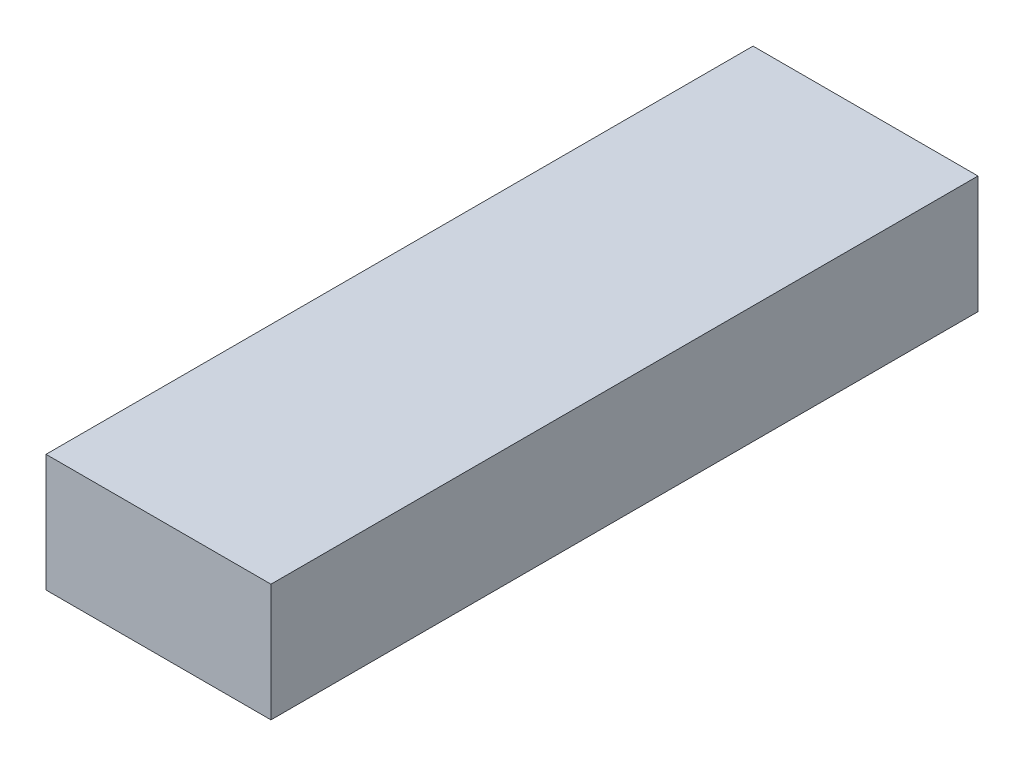
ISO-10303-21;
HEADER;
FILE_DESCRIPTION(('STEP AP214'),'2;1');
FILE_NAME('part.step','',(''),(''),'','','');
FILE_SCHEMA(('AUTOMOTIVE_DESIGN { 1 0 10303 214 1 1 1 1 }'));
ENDSEC;
DATA;
#1=APPLICATION_CONTEXT('core data for automotive mechanical design processes');
#2=APPLICATION_PROTOCOL_DEFINITION('international standard','automotive_design',2000,#1);
#3=PRODUCT_CONTEXT('',#1,'mechanical');
#4=PRODUCT('Part','Part','',(#3));
#5=PRODUCT_RELATED_PRODUCT_CATEGORY('part','',(#4));
#6=PRODUCT_DEFINITION_FORMATION('','',#4);
#7=PRODUCT_DEFINITION_CONTEXT('part definition',#1,'design');
#8=PRODUCT_DEFINITION('design','',#6,#7);
#9=PRODUCT_DEFINITION_SHAPE('','',#8);
#10=(LENGTH_UNIT() NAMED_UNIT(*) SI_UNIT(.MILLI.,.METRE.));
#11=(NAMED_UNIT(*) PLANE_ANGLE_UNIT() SI_UNIT($,.RADIAN.));
#12=(NAMED_UNIT(*) SI_UNIT($,.STERADIAN.) SOLID_ANGLE_UNIT());
#13=UNCERTAINTY_MEASURE_WITH_UNIT(LENGTH_MEASURE(1.E-05),#10,'distance_accuracy_value','');
#14=(GEOMETRIC_REPRESENTATION_CONTEXT(3) GLOBAL_UNCERTAINTY_ASSIGNED_CONTEXT((#13)) GLOBAL_UNIT_ASSIGNED_CONTEXT((#10,
#11,#12)) REPRESENTATION_CONTEXT('',''));
#15=CARTESIAN_POINT('',(0.,0.,0.));
#16=DIRECTION('',(0.,0.,1.));
#17=DIRECTION('',(1.,0.,0.));
#18=AXIS2_PLACEMENT_3D('',#15,#16,#17);
#19=CARTESIAN_POINT('',(24.5,-12.8,154.));
#20=DIRECTION('',(-1.,0.,0.));
#21=DIRECTION('',(0.,0.,1.));
#22=AXIS2_PLACEMENT_3D('',#19,#20,#21);
#23=PLANE('',#22);
#24=DIRECTION('',(0.,1.,0.));
#25=VECTOR('',#24,1.);
#26=CARTESIAN_POINT('',(24.5,-12.8,0.));
#27=LINE('',#26,#25);
#28=CARTESIAN_POINT('',(24.5,-12.8,0.));
#29=VERTEX_POINT('',#28);
#30=CARTESIAN_POINT('',(24.5,12.8,0.));
#31=VERTEX_POINT('',#30);
#32=EDGE_CURVE('E96',#29,#31,#27,.T.);
#33=ORIENTED_EDGE('',*,*,#32,.T.);
#34=DIRECTION('',(0.,0.,-1.));
#35=VECTOR('',#34,1.);
#36=CARTESIAN_POINT('',(24.5,12.8,154.));
#37=LINE('',#36,#35);
#38=CARTESIAN_POINT('',(24.5,12.8,154.));
#39=VERTEX_POINT('',#38);
#40=EDGE_CURVE('E11',#39,#31,#37,.T.);
#41=ORIENTED_EDGE('',*,*,#40,.F.);
#42=DIRECTION('',(0.,1.,0.));
#43=VECTOR('',#42,1.);
#44=CARTESIAN_POINT('',(24.5,-12.8,154.));
#45=LINE('',#44,#43);
#46=CARTESIAN_POINT('',(24.5,-12.8,154.));
#47=VERTEX_POINT('',#46);
#48=EDGE_CURVE('E84',#47,#39,#45,.T.);
#49=ORIENTED_EDGE('',*,*,#48,.F.);
#50=DIRECTION('',(0.,0.,-1.));
#51=VECTOR('',#50,1.);
#52=CARTESIAN_POINT('',(24.5,-12.8,154.));
#53=LINE('',#52,#51);
#54=EDGE_CURVE('E92',#47,#29,#53,.T.);
#55=ORIENTED_EDGE('',*,*,#54,.T.);
#56=EDGE_LOOP('',(#33,#41,#49,#55));
#57=FACE_BOUND('',#56,.T.);
#58=ADVANCED_FACE('F33',(#57),#23,.F.);
#59=CARTESIAN_POINT('',(-24.5,12.8,154.));
#60=DIRECTION('',(0.,-1.,0.));
#61=DIRECTION('',(0.,0.,-1.));
#62=AXIS2_PLACEMENT_3D('',#59,#60,#61);
#63=PLANE('',#62);
#64=DIRECTION('',(-1.,0.,0.));
#65=VECTOR('',#64,1.);
#66=CARTESIAN_POINT('',(-24.5,12.8,0.));
#67=LINE('',#66,#65);
#68=CARTESIAN_POINT('',(-24.5,12.8,0.));
#69=VERTEX_POINT('',#68);
#70=EDGE_CURVE('E88',#31,#69,#67,.T.);
#71=ORIENTED_EDGE('',*,*,#70,.T.);
#72=DIRECTION('',(0.,0.,-1.));
#73=VECTOR('',#72,1.);
#74=CARTESIAN_POINT('',(-24.5,12.8,154.));
#75=LINE('',#74,#73);
#76=CARTESIAN_POINT('',(-24.5,12.8,154.));
#77=VERTEX_POINT('',#76);
#78=EDGE_CURVE('E41',#77,#69,#75,.T.);
#79=ORIENTED_EDGE('',*,*,#78,.F.);
#80=DIRECTION('',(-1.,0.,0.));
#81=VECTOR('',#80,1.);
#82=CARTESIAN_POINT('',(-24.5,12.8,154.));
#83=LINE('',#82,#81);
#84=EDGE_CURVE('E79',#39,#77,#83,.T.);
#85=ORIENTED_EDGE('',*,*,#84,.F.);
#86=ORIENTED_EDGE('',*,*,#40,.T.);
#87=EDGE_LOOP('',(#71,#79,#85,#86));
#88=FACE_BOUND('',#87,.T.);
#89=ADVANCED_FACE('F87',(#88),#63,.F.);
#90=CARTESIAN_POINT('',(-24.5,-12.8,154.));
#91=DIRECTION('',(1.,0.,0.));
#92=DIRECTION('',(0.,0.,-1.));
#93=AXIS2_PLACEMENT_3D('',#90,#91,#92);
#94=PLANE('',#93);
#95=DIRECTION('',(0.,-1.,0.));
#96=VECTOR('',#95,1.);
#97=CARTESIAN_POINT('',(-24.5,-12.8,0.));
#98=LINE('',#97,#96);
#99=CARTESIAN_POINT('',(-24.5,-12.8,0.));
#100=VERTEX_POINT('',#99);
#101=EDGE_CURVE('E66',#69,#100,#98,.T.);
#102=ORIENTED_EDGE('',*,*,#101,.T.);
#103=DIRECTION('',(0.,0.,-1.));
#104=VECTOR('',#103,1.);
#105=CARTESIAN_POINT('',(-24.5,-12.8,154.));
#106=LINE('',#105,#104);
#107=CARTESIAN_POINT('',(-24.5,-12.8,154.));
#108=VERTEX_POINT('',#107);
#109=EDGE_CURVE('E89',#108,#100,#106,.T.);
#110=ORIENTED_EDGE('',*,*,#109,.F.);
#111=DIRECTION('',(0.,-1.,0.));
#112=VECTOR('',#111,1.);
#113=CARTESIAN_POINT('',(-24.5,-12.8,154.));
#114=LINE('',#113,#112);
#115=EDGE_CURVE('E82',#77,#108,#114,.T.);
#116=ORIENTED_EDGE('',*,*,#115,.F.);
#117=ORIENTED_EDGE('',*,*,#78,.T.);
#118=EDGE_LOOP('',(#102,#110,#116,#117));
#119=FACE_BOUND('',#118,.T.);
#120=ADVANCED_FACE('F90',(#119),#94,.F.);
#121=CARTESIAN_POINT('',(-24.5,-12.8,154.));
#122=DIRECTION('',(0.,1.,0.));
#123=DIRECTION('',(0.,0.,1.));
#124=AXIS2_PLACEMENT_3D('',#121,#122,#123);
#125=PLANE('',#124);
#126=DIRECTION('',(1.,0.,0.));
#127=VECTOR('',#126,1.);
#128=CARTESIAN_POINT('',(-24.5,-12.8,0.));
#129=LINE('',#128,#127);
#130=EDGE_CURVE('E72',#100,#29,#129,.T.);
#131=ORIENTED_EDGE('',*,*,#130,.T.);
#132=ORIENTED_EDGE('',*,*,#54,.F.);
#133=DIRECTION('',(1.,0.,0.));
#134=VECTOR('',#133,1.);
#135=CARTESIAN_POINT('',(-24.5,-12.8,154.));
#136=LINE('',#135,#134);
#137=EDGE_CURVE('E49',#108,#47,#136,.T.);
#138=ORIENTED_EDGE('',*,*,#137,.F.);
#139=ORIENTED_EDGE('',*,*,#109,.T.);
#140=EDGE_LOOP('',(#131,#132,#138,#139));
#141=FACE_BOUND('',#140,.T.);
#142=ADVANCED_FACE('F103',(#141),#125,.F.);
#143=CARTESIAN_POINT('',(0.,0.,154.));
#144=DIRECTION('',(0.,0.,-1.));
#145=DIRECTION('',(-1.,0.,0.));
#146=AXIS2_PLACEMENT_3D('',#143,#144,#145);
#147=PLANE('',#146);
#148=ORIENTED_EDGE('',*,*,#48,.T.);
#149=ORIENTED_EDGE('',*,*,#84,.T.);
#150=ORIENTED_EDGE('',*,*,#115,.T.);
#151=ORIENTED_EDGE('',*,*,#137,.T.);
#152=EDGE_LOOP('',(#148,#149,#150,#151));
#153=FACE_BOUND('',#152,.T.);
#154=ADVANCED_FACE('F80',(#153),#147,.F.);
#155=CARTESIAN_POINT('',(0.,0.,0.));
#156=DIRECTION('',(0.,0.,-1.));
#157=DIRECTION('',(-1.,0.,0.));
#158=AXIS2_PLACEMENT_3D('',#155,#156,#157);
#159=PLANE('',#158);
#160=ORIENTED_EDGE('',*,*,#32,.F.);
#161=ORIENTED_EDGE('',*,*,#130,.F.);
#162=ORIENTED_EDGE('',*,*,#101,.F.);
#163=ORIENTED_EDGE('',*,*,#70,.F.);
#164=EDGE_LOOP('',(#160,#161,#162,#163));
#165=FACE_BOUND('',#164,.T.);
#166=ADVANCED_FACE('F106',(#165),#159,.T.);
#167=CLOSED_SHELL('',(#58,#89,#120,#142,#154,#166));
#168=MANIFOLD_SOLID_BREP('B2',#167);
#169=ADVANCED_BREP_SHAPE_REPRESENTATION('',(#18,#168),#14);
#170=SHAPE_DEFINITION_REPRESENTATION(#9,#169);
ENDSEC;
END-ISO-10303-21;
